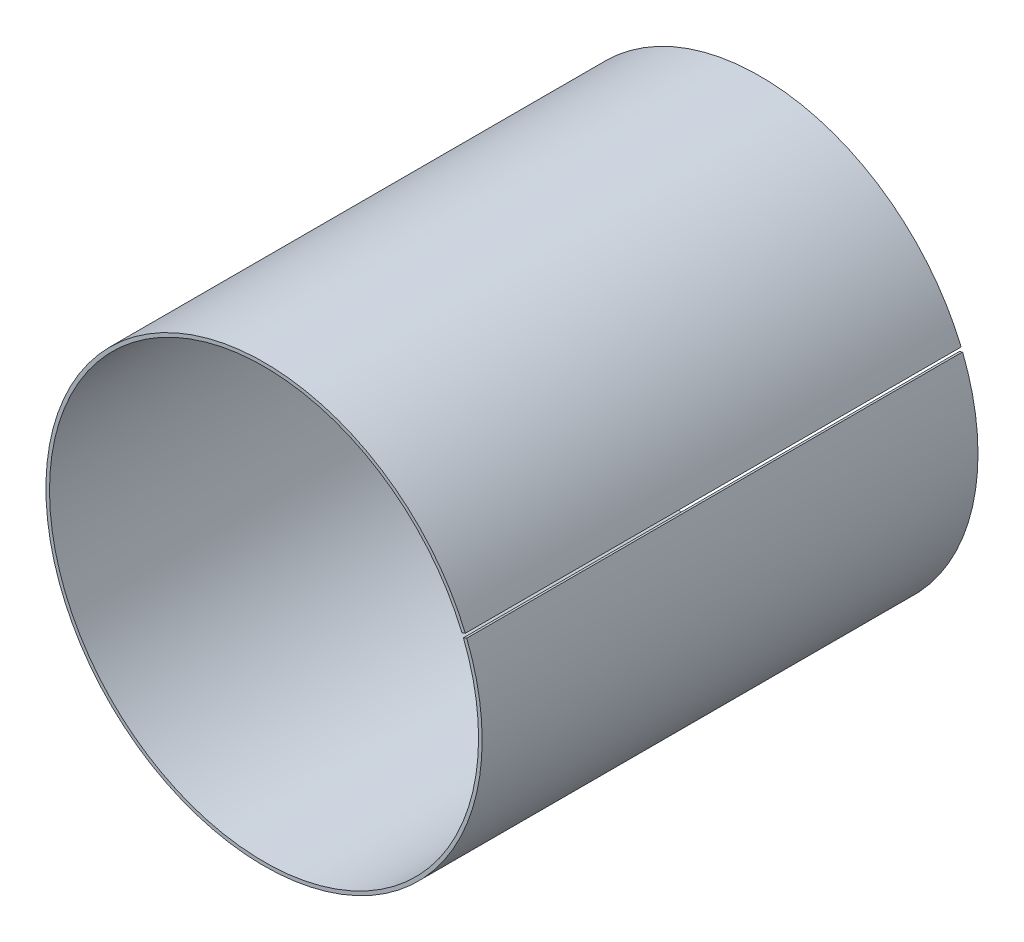
ISO-10303-21;
HEADER;
FILE_DESCRIPTION(('STEP AP214'),'2;1');
FILE_NAME('part.step','',(''),(''),'','','');
FILE_SCHEMA(('AUTOMOTIVE_DESIGN { 1 0 10303 214 1 1 1 1 }'));
ENDSEC;
DATA;
#1=APPLICATION_CONTEXT('core data for automotive mechanical design processes');
#2=APPLICATION_PROTOCOL_DEFINITION('international standard','automotive_design',2000,#1);
#3=PRODUCT_CONTEXT('',#1,'mechanical');
#4=PRODUCT('Part','Part','',(#3));
#5=PRODUCT_RELATED_PRODUCT_CATEGORY('part','',(#4));
#6=PRODUCT_DEFINITION_FORMATION('','',#4);
#7=PRODUCT_DEFINITION_CONTEXT('part definition',#1,'design');
#8=PRODUCT_DEFINITION('design','',#6,#7);
#9=PRODUCT_DEFINITION_SHAPE('','',#8);
#10=(LENGTH_UNIT() NAMED_UNIT(*) SI_UNIT(.MILLI.,.METRE.));
#11=(NAMED_UNIT(*) PLANE_ANGLE_UNIT() SI_UNIT($,.RADIAN.));
#12=(NAMED_UNIT(*) SI_UNIT($,.STERADIAN.) SOLID_ANGLE_UNIT());
#13=UNCERTAINTY_MEASURE_WITH_UNIT(LENGTH_MEASURE(1.E-05),#10,'distance_accuracy_value','');
#14=(GEOMETRIC_REPRESENTATION_CONTEXT(3) GLOBAL_UNCERTAINTY_ASSIGNED_CONTEXT((#13)) GLOBAL_UNIT_ASSIGNED_CONTEXT((#10,
#11,#12)) REPRESENTATION_CONTEXT('',''));
#15=CARTESIAN_POINT('',(0.,0.,0.));
#16=DIRECTION('',(0.,0.,1.));
#17=DIRECTION('',(1.,0.,0.));
#18=AXIS2_PLACEMENT_3D('',#15,#16,#17);
#19=CARTESIAN_POINT('',(33.4154129496453,13.9554768336549,41.5));
#20=DIRECTION('',(-0.385377337484428,0.92275907351454,0.));
#21=DIRECTION('',(0.,0.,1.));
#22=AXIS2_PLACEMENT_3D('',#19,#20,#21);
#23=PLANE('',#22);
#24=DIRECTION('',(0.92275907351454,0.385377337484428,0.));
#25=VECTOR('',#24,1.);
#26=CARTESIAN_POINT('',(33.4154129496453,13.9554768336549,83.));
#27=LINE('',#26,#25);
#28=CARTESIAN_POINT('',(33.1385852275909,13.8398636324095,83.));
#29=VERTEX_POINT('',#28);
#30=CARTESIAN_POINT('',(33.6922406716997,14.0710900349002,83.));
#31=VERTEX_POINT('',#30);
#32=EDGE_CURVE('E11',#29,#31,#27,.T.);
#33=ORIENTED_EDGE('',*,*,#32,.F.);
#34=DIRECTION('',(0.,0.,-1.));
#35=VECTOR('',#34,1.);
#36=CARTESIAN_POINT('',(33.1385852275909,13.8398636324095,325.003368453233));
#37=LINE('',#36,#35);
#38=CARTESIAN_POINT('',(33.1385852275909,13.8398636324096,0.));
#39=VERTEX_POINT('',#38);
#40=EDGE_CURVE('E86',#39,#29,#37,.F.);
#41=ORIENTED_EDGE('',*,*,#40,.F.);
#42=DIRECTION('',(0.92275907351454,0.385377337484429,0.));
#43=VECTOR('',#42,1.);
#44=CARTESIAN_POINT('',(33.4154129496453,13.9554768336549,0.));
#45=LINE('',#44,#43);
#46=CARTESIAN_POINT('',(33.6922406716997,14.0710900349002,0.));
#47=VERTEX_POINT('',#46);
#48=EDGE_CURVE('E48',#39,#47,#45,.T.);
#49=ORIENTED_EDGE('',*,*,#48,.T.);
#50=DIRECTION('',(0.,0.,-1.));
#51=VECTOR('',#50,1.);
#52=CARTESIAN_POINT('',(33.6922406716997,14.0710900349002,325.003368453233));
#53=LINE('',#52,#51);
#54=EDGE_CURVE('E85',#47,#31,#53,.F.);
#55=ORIENTED_EDGE('',*,*,#54,.T.);
#56=EDGE_LOOP('',(#33,#41,#49,#55));
#57=FACE_BOUND('',#56,.T.);
#58=ADVANCED_FACE('F38',(#57),#23,.F.);
#59=CARTESIAN_POINT('',(0.,0.,0.));
#60=DIRECTION('',(0.,0.,1.));
#61=DIRECTION('',(1.,0.,0.));
#62=AXIS2_PLACEMENT_3D('',#59,#60,#61);
#63=PLANE('',#62);
#64=ORIENTED_EDGE('',*,*,#48,.F.);
#65=CARTESIAN_POINT('',(0.,0.,0.));
#66=DIRECTION('',(0.,0.,-1.));
#67=DIRECTION('',(0.,1.,0.));
#68=AXIS2_PLACEMENT_3D('',#65,#66,#67);
#69=CIRCLE('',#68,35.9125);
#70=CARTESIAN_POINT('',(33.3750769856996,13.2594076959954,0.));
#71=VERTEX_POINT('',#70);
#72=EDGE_CURVE('E106',#71,#39,#69,.T.);
#73=ORIENTED_EDGE('',*,*,#72,.F.);
#74=DIRECTION('',(0.929344294763652,0.369214276254658,0.));
#75=VECTOR('',#74,1.);
#76=CARTESIAN_POINT('',(33.6538802741287,13.3701719788718,0.));
#77=LINE('',#76,#75);
#78=CARTESIAN_POINT('',(33.9326835625578,13.4809362617482,0.));
#79=VERTEX_POINT('',#78);
#80=EDGE_CURVE('E81',#71,#79,#77,.T.);
#81=ORIENTED_EDGE('',*,*,#80,.T.);
#82=CARTESIAN_POINT('',(0.,0.,0.));
#83=DIRECTION('',(0.,0.,-1.));
#84=DIRECTION('',(0.,1.,0.));
#85=AXIS2_PLACEMENT_3D('',#82,#83,#84);
#86=CIRCLE('',#85,36.5125);
#87=EDGE_CURVE('E93',#79,#47,#86,.T.);
#88=ORIENTED_EDGE('',*,*,#87,.T.);
#89=EDGE_LOOP('',(#64,#73,#81,#88));
#90=FACE_BOUND('',#89,.T.);
#91=ADVANCED_FACE('F96',(#90),#63,.F.);
#92=CARTESIAN_POINT('',(33.6538802741287,13.3701719788718,41.5));
#93=DIRECTION('',(0.369214276254658,-0.929344294763652,0.));
#94=DIRECTION('',(0.,0.,-1.));
#95=AXIS2_PLACEMENT_3D('',#92,#93,#94);
#96=PLANE('',#95);
#97=ORIENTED_EDGE('',*,*,#80,.F.);
#98=DIRECTION('',(0.,0.,-1.));
#99=VECTOR('',#98,1.);
#100=CARTESIAN_POINT('',(33.3750769856996,13.2594076959954,325.003368453233));
#101=LINE('',#100,#99);
#102=CARTESIAN_POINT('',(33.3750769856996,13.2594076959954,83.));
#103=VERTEX_POINT('',#102);
#104=EDGE_CURVE('E97',#103,#71,#101,.T.);
#105=ORIENTED_EDGE('',*,*,#104,.F.);
#106=DIRECTION('',(0.929344294763652,0.369214276254658,0.));
#107=VECTOR('',#106,1.);
#108=CARTESIAN_POINT('',(33.6538802741287,13.3701719788718,83.));
#109=LINE('',#108,#107);
#110=CARTESIAN_POINT('',(33.9326835625578,13.4809362617482,83.));
#111=VERTEX_POINT('',#110);
#112=EDGE_CURVE('E42',#103,#111,#109,.T.);
#113=ORIENTED_EDGE('',*,*,#112,.T.);
#114=DIRECTION('',(0.,0.,-1.));
#115=VECTOR('',#114,1.);
#116=CARTESIAN_POINT('',(33.9326835625578,13.4809362617482,325.003368453233));
#117=LINE('',#116,#115);
#118=EDGE_CURVE('E103',#111,#79,#117,.T.);
#119=ORIENTED_EDGE('',*,*,#118,.T.);
#120=EDGE_LOOP('',(#97,#105,#113,#119));
#121=FACE_BOUND('',#120,.T.);
#122=ADVANCED_FACE('F110',(#121),#96,.F.);
#123=CARTESIAN_POINT('',(0.,0.,83.));
#124=DIRECTION('',(0.,0.,-1.));
#125=DIRECTION('',(-1.,0.,0.));
#126=AXIS2_PLACEMENT_3D('',#123,#124,#125);
#127=PLANE('',#126);
#128=CARTESIAN_POINT('',(0.,0.,83.));
#129=DIRECTION('',(0.,0.,-1.));
#130=DIRECTION('',(0.,1.,0.));
#131=AXIS2_PLACEMENT_3D('',#128,#129,#130);
#132=CIRCLE('',#131,35.9125);
#133=EDGE_CURVE('E100',#29,#103,#132,.F.);
#134=ORIENTED_EDGE('',*,*,#133,.F.);
#135=ORIENTED_EDGE('',*,*,#32,.T.);
#136=CARTESIAN_POINT('',(0.,0.,83.));
#137=DIRECTION('',(0.,0.,-1.));
#138=DIRECTION('',(0.,1.,0.));
#139=AXIS2_PLACEMENT_3D('',#136,#137,#138);
#140=CIRCLE('',#139,36.5125);
#141=EDGE_CURVE('E94',#31,#111,#140,.F.);
#142=ORIENTED_EDGE('',*,*,#141,.T.);
#143=ORIENTED_EDGE('',*,*,#112,.F.);
#144=EDGE_LOOP('',(#134,#135,#142,#143));
#145=FACE_BOUND('',#144,.T.);
#146=ADVANCED_FACE('F40',(#145),#127,.F.);
#147=CARTESIAN_POINT('',(0.,0.,325.003368453233));
#148=DIRECTION('',(0.,0.,-1.));
#149=DIRECTION('',(0.,1.,0.));
#150=AXIS2_PLACEMENT_3D('',#147,#148,#149);
#151=CYLINDRICAL_SURFACE('',#150,36.5125);
#152=ORIENTED_EDGE('',*,*,#118,.F.);
#153=ORIENTED_EDGE('',*,*,#141,.F.);
#154=ORIENTED_EDGE('',*,*,#54,.F.);
#155=ORIENTED_EDGE('',*,*,#87,.F.);
#156=EDGE_LOOP('',(#152,#153,#154,#155));
#157=FACE_BOUND('',#156,.T.);
#158=ADVANCED_FACE('F92',(#157),#151,.T.);
#159=CARTESIAN_POINT('',(0.,0.,325.003368453233));
#160=DIRECTION('',(0.,0.,-1.));
#161=DIRECTION('',(0.,1.,0.));
#162=AXIS2_PLACEMENT_3D('',#159,#160,#161);
#163=CYLINDRICAL_SURFACE('',#162,35.9125);
#164=ORIENTED_EDGE('',*,*,#104,.T.);
#165=ORIENTED_EDGE('',*,*,#72,.T.);
#166=ORIENTED_EDGE('',*,*,#40,.T.);
#167=ORIENTED_EDGE('',*,*,#133,.T.);
#168=EDGE_LOOP('',(#164,#165,#166,#167));
#169=FACE_BOUND('',#168,.T.);
#170=ADVANCED_FACE('F112',(#169),#163,.F.);
#171=CLOSED_SHELL('',(#58,#91,#122,#146,#158,#170));
#172=MANIFOLD_SOLID_BREP('B2',#171);
#173=ADVANCED_BREP_SHAPE_REPRESENTATION('',(#18,#172),#14);
#174=SHAPE_DEFINITION_REPRESENTATION(#9,#173);
ENDSEC;
END-ISO-10303-21;
